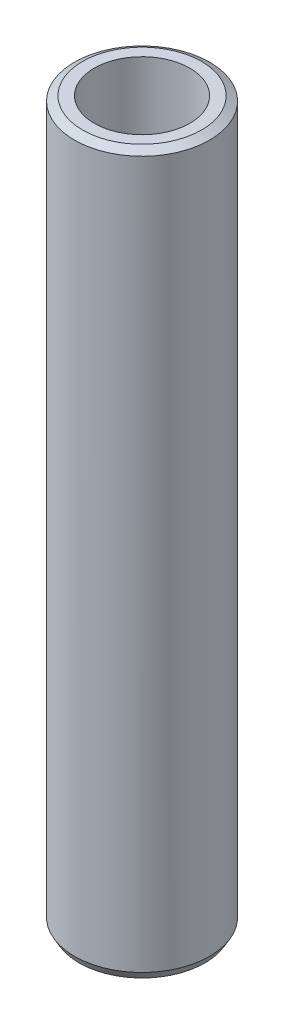
ISO-10303-21;
HEADER;
FILE_DESCRIPTION(('STEP AP214'),'2;1');
FILE_NAME('part.step','',(''),(''),'','','');
FILE_SCHEMA(('AUTOMOTIVE_DESIGN { 1 0 10303 214 1 1 1 1 }'));
ENDSEC;
DATA;
#1=APPLICATION_CONTEXT('core data for automotive mechanical design processes');
#2=APPLICATION_PROTOCOL_DEFINITION('international standard','automotive_design',2000,#1);
#3=PRODUCT_CONTEXT('',#1,'mechanical');
#4=PRODUCT('Part','Part','',(#3));
#5=PRODUCT_RELATED_PRODUCT_CATEGORY('part','',(#4));
#6=PRODUCT_DEFINITION_FORMATION('','',#4);
#7=PRODUCT_DEFINITION_CONTEXT('part definition',#1,'design');
#8=PRODUCT_DEFINITION('design','',#6,#7);
#9=PRODUCT_DEFINITION_SHAPE('','',#8);
#10=(LENGTH_UNIT() NAMED_UNIT(*) SI_UNIT(.MILLI.,.METRE.));
#11=(NAMED_UNIT(*) PLANE_ANGLE_UNIT() SI_UNIT($,.RADIAN.));
#12=(NAMED_UNIT(*) SI_UNIT($,.STERADIAN.) SOLID_ANGLE_UNIT());
#13=UNCERTAINTY_MEASURE_WITH_UNIT(LENGTH_MEASURE(1.E-05),#10,'distance_accuracy_value','');
#14=(GEOMETRIC_REPRESENTATION_CONTEXT(3) GLOBAL_UNCERTAINTY_ASSIGNED_CONTEXT((#13)) GLOBAL_UNIT_ASSIGNED_CONTEXT((#10,
#11,#12)) REPRESENTATION_CONTEXT('',''));
#15=CARTESIAN_POINT('',(0.,0.,0.));
#16=DIRECTION('',(0.,0.,1.));
#17=DIRECTION('',(1.,0.,0.));
#18=AXIS2_PLACEMENT_3D('',#15,#16,#17);
#19=CARTESIAN_POINT('',(0.,425.990256327083,0.));
#20=DIRECTION('',(0.,-1.,0.));
#21=DIRECTION('',(0.,0.,-1.));
#22=AXIS2_PLACEMENT_3D('',#19,#20,#21);
#23=CYLINDRICAL_SURFACE('',#22,40.);
#24=CARTESIAN_POINT('',(0.,423.223731019234,0.));
#25=DIRECTION('',(0.,1.,0.));
#26=DIRECTION('',(0.,0.,1.));
#27=AXIS2_PLACEMENT_3D('',#24,#25,#26);
#28=CIRCLE('',#27,40.);
#29=CARTESIAN_POINT('',(0.,423.223731019234,-40.));
#30=VERTEX_POINT('',#29);
#31=EDGE_CURVE('E50',#30,#30,#28,.F.);
#32=CARTESIAN_POINT('',(0.,4.79176239362122,0.));
#33=DIRECTION('',(0.,1.,0.));
#34=DIRECTION('',(0.,0.,1.));
#35=AXIS2_PLACEMENT_3D('',#32,#33,#34);
#36=CIRCLE('',#35,40.);
#37=CARTESIAN_POINT('',(0.,4.79176239362117,-40.));
#38=VERTEX_POINT('',#37);
#39=EDGE_CURVE('E51',#38,#38,#36,.T.);
#40=CARTESIAN_POINT('',(0.,423.223731019234,-40.));
#41=CARTESIAN_POINT('',(0.,418.865064679384,-40.));
#42=CARTESIAN_POINT('',(0.,414.506398339533,-40.));
#43=CARTESIAN_POINT('',(0.,405.789065659833,-40.));
#44=CARTESIAN_POINT('',(0.,401.430399319983,-40.));
#45=CARTESIAN_POINT('',(0.,392.713066640283,-40.));
#46=CARTESIAN_POINT('',(0.,388.354400300433,-40.));
#47=CARTESIAN_POINT('',(0.,379.637067620732,-40.));
#48=CARTESIAN_POINT('',(0.,375.278401280882,-40.));
#49=CARTESIAN_POINT('',(0.,366.561068601182,-40.));
#50=CARTESIAN_POINT('',(0.,362.202402261332,-40.));
#51=CARTESIAN_POINT('',(0.,353.485069581632,-40.));
#52=CARTESIAN_POINT('',(0.,349.126403241781,-40.));
#53=CARTESIAN_POINT('',(0.,340.409070562081,-40.));
#54=CARTESIAN_POINT('',(0.,336.050404222231,-40.));
#55=CARTESIAN_POINT('',(0.,327.333071542531,-40.));
#56=CARTESIAN_POINT('',(0.,322.974405202681,-40.));
#57=CARTESIAN_POINT('',(0.,314.25707252298,-40.));
#58=CARTESIAN_POINT('',(0.,309.89840618313,-40.));
#59=CARTESIAN_POINT('',(0.,301.18107350343,-40.));
#60=CARTESIAN_POINT('',(0.,296.82240716358,-40.));
#61=CARTESIAN_POINT('',(0.,288.10507448388,-40.));
#62=CARTESIAN_POINT('',(0.,283.746408144029,-40.));
#63=CARTESIAN_POINT('',(0.,275.029075464329,-40.));
#64=CARTESIAN_POINT('',(0.,270.670409124479,-40.));
#65=CARTESIAN_POINT('',(0.,261.953076444779,-40.));
#66=CARTESIAN_POINT('',(0.,257.594410104929,-40.));
#67=CARTESIAN_POINT('',(0.,248.877077425228,-40.));
#68=CARTESIAN_POINT('',(0.,244.518411085378,-40.));
#69=CARTESIAN_POINT('',(0.,235.801078405678,-40.));
#70=CARTESIAN_POINT('',(0.,231.442412065828,-40.));
#71=CARTESIAN_POINT('',(0.,222.725079386128,-40.));
#72=CARTESIAN_POINT('',(0.,218.366413046278,-40.));
#73=CARTESIAN_POINT('',(0.,209.649080366577,-40.));
#74=CARTESIAN_POINT('',(0.,205.290414026727,-40.));
#75=CARTESIAN_POINT('',(0.,196.573081347027,-40.));
#76=CARTESIAN_POINT('',(0.,192.214415007177,-40.));
#77=CARTESIAN_POINT('',(0.,183.497082327477,-40.));
#78=CARTESIAN_POINT('',(0.,179.138415987626,-40.));
#79=CARTESIAN_POINT('',(0.,170.421083307926,-40.));
#80=CARTESIAN_POINT('',(0.,166.062416968076,-40.));
#81=CARTESIAN_POINT('',(0.,157.345084288376,-40.));
#82=CARTESIAN_POINT('',(0.,152.986417948526,-40.));
#83=CARTESIAN_POINT('',(0.,144.269085268825,-40.));
#84=CARTESIAN_POINT('',(0.,139.910418928975,-40.));
#85=CARTESIAN_POINT('',(0.,131.193086249275,-40.));
#86=CARTESIAN_POINT('',(0.,126.834419909425,-40.));
#87=CARTESIAN_POINT('',(0.,118.117087229725,-40.));
#88=CARTESIAN_POINT('',(0.,113.758420889874,-40.));
#89=CARTESIAN_POINT('',(0.,105.041088210174,-40.));
#90=CARTESIAN_POINT('',(0.,100.682421870324,-40.));
#91=CARTESIAN_POINT('',(0.,91.9650891906238,-40.));
#92=CARTESIAN_POINT('',(0.,87.6064228507737,-40.));
#93=CARTESIAN_POINT('',(0.,78.8890901710734,-40.));
#94=CARTESIAN_POINT('',(0.,74.5304238312233,-40.));
#95=CARTESIAN_POINT('',(0.,65.813091151523,-40.));
#96=CARTESIAN_POINT('',(0.,61.4544248116729,-40.));
#97=CARTESIAN_POINT('',(0.,52.7370921319726,-40.));
#98=CARTESIAN_POINT('',(0.,48.3784257921225,-40.));
#99=CARTESIAN_POINT('',(0.,39.6610931124223,-40.));
#100=CARTESIAN_POINT('',(0.,35.3024267725721,-40.));
#101=CARTESIAN_POINT('',(0.,26.5850940928719,-40.));
#102=CARTESIAN_POINT('',(0.,22.2264277530217,-40.));
#103=CARTESIAN_POINT('',(0.,13.5090950733214,-40.));
#104=CARTESIAN_POINT('',(0.,9.15042873347128,-40.));
#105=CARTESIAN_POINT('',(0.,4.79176239362117,-40.));
#106=B_SPLINE_CURVE_WITH_KNOTS('',3,(#40,#41,#42,#43,#44,#45,#46,#47,#48,#49,#50,#51,#52,#53,
#54,#55,#56,#57,#58,#59,#60,#61,#62,#63,#64,#65,#66,#67,#68,#69,#70,#71,#72,#73,#74,#75,#76,#77,
#78,#79,#80,#81,#82,#83,#84,#85,#86,#87,#88,#89,#90,#91,#92,#93,#94,#95,#96,#97,#98,#99,#100,
#101,#102,#103,#104,#105),.UNSPECIFIED.,.F.,.F.,(4,2,2,2,2,2,2,2,2,2,2,2,2,2,2,2,2,2,2,2,2,2,2,
2,2,2,2,2,2,2,2,2,4),(0.,13.0759990195504,26.1519980391008,39.2279970586512,52.3039960782016,
65.379995097752,78.4559941173024,91.5319931368527,104.607992156403,117.683991175954,
130.759990195504,143.835989215054,156.911988234605,169.987987254155,183.063986273705,
196.139985293256,209.215984312806,222.291983332357,235.367982351907,248.443981371457,
261.519980391008,274.595979410558,287.671978430109,300.747977449659,313.823976469209,
326.89997548876,339.97597450831,353.051973527861,366.127972547411,379.203971566961,
392.279970586512,405.355969606062,418.431968625613),.UNSPECIFIED.);
#107=EDGE_CURVE('BSEAM39',#30,#38,#106,.T.);
#108=ORIENTED_EDGE('',*,*,#31,.T.);
#109=ORIENTED_EDGE('',*,*,#39,.T.);
#110=ORIENTED_EDGE('',*,*,#107,.T.);
#111=ORIENTED_EDGE('',*,*,#107,.F.);
#112=EDGE_LOOP('',(#108,#110,#109,#111));
#113=FACE_BOUND('',#112,.T.);
#114=ADVANCED_FACE('F39',(#113),#23,.T.);
#115=CARTESIAN_POINT('',(0.,425.990256327083,0.));
#116=DIRECTION('',(0.,1.,0.));
#117=DIRECTION('',(0.,0.,1.));
#118=AXIS2_PLACEMENT_3D('',#115,#116,#117);
#119=PLANE('',#118);
#120=CARTESIAN_POINT('',(0.,425.990256327083,0.));
#121=DIRECTION('',(0.,1.,0.));
#122=DIRECTION('',(0.,0.,1.));
#123=AXIS2_PLACEMENT_3D('',#120,#121,#122);
#124=CIRCLE('',#123,35.2082376063796);
#125=CARTESIAN_POINT('',(0.,425.990256327083,35.2082376063796));
#126=VERTEX_POINT('',#125);
#127=EDGE_CURVE('E54',#126,#126,#124,.T.);
#128=ORIENTED_EDGE('',*,*,#127,.T.);
#129=EDGE_LOOP('',(#128));
#130=FACE_BOUND('',#129,.T.);
#131=CARTESIAN_POINT('',(0.,425.990256327083,0.));
#132=DIRECTION('',(0.,1.,0.));
#133=DIRECTION('',(0.,0.,1.));
#134=AXIS2_PLACEMENT_3D('',#131,#132,#133);
#135=CIRCLE('',#134,28.3068310248197);
#136=CARTESIAN_POINT('',(0.,425.990256327083,-28.3068310248197));
#137=VERTEX_POINT('',#136);
#138=EDGE_CURVE('E58',#137,#137,#135,.T.);
#139=ORIENTED_EDGE('',*,*,#138,.F.);
#140=EDGE_LOOP('',(#139));
#141=FACE_BOUND('',#140,.T.);
#142=ADVANCED_FACE('F69',(#130,#141),#119,.T.);
#143=CARTESIAN_POINT('',(0.,0.,0.));
#144=DIRECTION('',(0.,1.,0.));
#145=DIRECTION('',(0.,0.,1.));
#146=AXIS2_PLACEMENT_3D('',#143,#144,#145);
#147=PLANE('',#146);
#148=CARTESIAN_POINT('',(0.,0.,0.));
#149=DIRECTION('',(0.,1.,0.));
#150=DIRECTION('',(0.,0.,1.));
#151=AXIS2_PLACEMENT_3D('',#148,#149,#150);
#152=CIRCLE('',#151,37.23347469215);
#153=CARTESIAN_POINT('',(0.,0.,37.23347469215));
#154=VERTEX_POINT('',#153);
#155=EDGE_CURVE('E10',#154,#154,#152,.F.);
#156=ORIENTED_EDGE('',*,*,#155,.T.);
#157=EDGE_LOOP('',(#156));
#158=FACE_BOUND('',#157,.T.);
#159=CARTESIAN_POINT('',(0.,0.,0.));
#160=DIRECTION('',(0.,1.,0.));
#161=DIRECTION('',(0.,0.,1.));
#162=AXIS2_PLACEMENT_3D('',#159,#160,#161);
#163=CIRCLE('',#162,28.3068310248197);
#164=CARTESIAN_POINT('',(0.,0.,-28.3068310248197));
#165=VERTEX_POINT('',#164);
#166=EDGE_CURVE('E63',#165,#165,#163,.T.);
#167=ORIENTED_EDGE('',*,*,#166,.T.);
#168=EDGE_LOOP('',(#167));
#169=FACE_BOUND('',#168,.T.);
#170=ADVANCED_FACE('F75',(#158,#169),#147,.F.);
#171=CARTESIAN_POINT('',(0.,425.990256327083,0.));
#172=DIRECTION('',(0.,-1.,0.));
#173=DIRECTION('',(0.,0.,-1.));
#174=AXIS2_PLACEMENT_3D('',#171,#172,#173);
#175=CYLINDRICAL_SURFACE('',#174,28.3068310248197);
#176=CARTESIAN_POINT('',(0.,425.990256327083,-28.3068310248197));
#177=CARTESIAN_POINT('',(0.,421.552857823676,-28.3068310248197));
#178=CARTESIAN_POINT('',(0.,417.115459320269,-28.3068310248197));
#179=CARTESIAN_POINT('',(0.,408.240662313455,-28.3068310248197));
#180=CARTESIAN_POINT('',(0.,403.803263810047,-28.3068310248197));
#181=CARTESIAN_POINT('',(0.,394.928466803233,-28.3068310248197));
#182=CARTESIAN_POINT('',(0.,390.491068299826,-28.3068310248197));
#183=CARTESIAN_POINT('',(0.,381.616271293012,-28.3068310248197));
#184=CARTESIAN_POINT('',(0.,377.178872789605,-28.3068310248197));
#185=CARTESIAN_POINT('',(0.,368.304075782791,-28.3068310248197));
#186=CARTESIAN_POINT('',(0.,363.866677279384,-28.3068310248197));
#187=CARTESIAN_POINT('',(0.,354.991880272569,-28.3068310248197));
#188=CARTESIAN_POINT('',(0.,350.554481769162,-28.3068310248197));
#189=CARTESIAN_POINT('',(0.,341.679684762348,-28.3068310248197));
#190=CARTESIAN_POINT('',(0.,337.242286258941,-28.3068310248197));
#191=CARTESIAN_POINT('',(0.,328.367489252127,-28.3068310248197));
#192=CARTESIAN_POINT('',(0.,323.930090748719,-28.3068310248197));
#193=CARTESIAN_POINT('',(0.,315.055293741905,-28.3068310248197));
#194=CARTESIAN_POINT('',(0.,310.617895238498,-28.3068310248197));
#195=CARTESIAN_POINT('',(0.,301.743098231684,-28.3068310248197));
#196=CARTESIAN_POINT('',(0.,297.305699728277,-28.3068310248197));
#197=CARTESIAN_POINT('',(0.,288.430902721462,-28.3068310248197));
#198=CARTESIAN_POINT('',(0.,283.993504218055,-28.3068310248197));
#199=CARTESIAN_POINT('',(0.,275.118707211241,-28.3068310248197));
#200=CARTESIAN_POINT('',(0.,270.681308707834,-28.3068310248197));
#201=CARTESIAN_POINT('',(0.,261.80651170102,-28.3068310248197));
#202=CARTESIAN_POINT('',(0.,257.369113197613,-28.3068310248197));
#203=CARTESIAN_POINT('',(0.,248.494316190798,-28.3068310248197));
#204=CARTESIAN_POINT('',(0.,244.056917687391,-28.3068310248197));
#205=CARTESIAN_POINT('',(0.,235.182120680577,-28.3068310248197));
#206=CARTESIAN_POINT('',(0.,230.74472217717,-28.3068310248197));
#207=CARTESIAN_POINT('',(0.,221.869925170356,-28.3068310248197));
#208=CARTESIAN_POINT('',(0.,217.432526666949,-28.3068310248197));
#209=CARTESIAN_POINT('',(0.,208.557729660134,-28.3068310248197));
#210=CARTESIAN_POINT('',(0.,204.120331156727,-28.3068310248197));
#211=CARTESIAN_POINT('',(0.,195.245534149913,-28.3068310248197));
#212=CARTESIAN_POINT('',(0.,190.808135646506,-28.3068310248197));
#213=CARTESIAN_POINT('',(0.,181.933338639692,-28.3068310248197));
#214=CARTESIAN_POINT('',(0.,177.495940136285,-28.3068310248197));
#215=CARTESIAN_POINT('',(0.,168.62114312947,-28.3068310248197));
#216=CARTESIAN_POINT('',(0.,164.183744626063,-28.3068310248197));
#217=CARTESIAN_POINT('',(0.,155.308947619249,-28.3068310248197));
#218=CARTESIAN_POINT('',(0.,150.871549115842,-28.3068310248197));
#219=CARTESIAN_POINT('',(0.,141.996752109028,-28.3068310248197));
#220=CARTESIAN_POINT('',(0.,137.559353605621,-28.3068310248197));
#221=CARTESIAN_POINT('',(0.,128.684556598806,-28.3068310248197));
#222=CARTESIAN_POINT('',(0.,124.247158095399,-28.3068310248197));
#223=CARTESIAN_POINT('',(0.,115.372361088585,-28.3068310248197));
#224=CARTESIAN_POINT('',(0.,110.934962585178,-28.3068310248197));
#225=CARTESIAN_POINT('',(0.,102.060165578364,-28.3068310248197));
#226=CARTESIAN_POINT('',(0.,97.6227670749565,-28.3068310248197));
#227=CARTESIAN_POINT('',(0.,88.7479700681423,-28.3068310248197));
#228=CARTESIAN_POINT('',(0.,84.3105715647351,-28.3068310248197));
#229=CARTESIAN_POINT('',(0.,75.4357745579209,-28.3068310248197));
#230=CARTESIAN_POINT('',(0.,70.9983760545138,-28.3068310248197));
#231=CARTESIAN_POINT('',(0.,62.1235790476996,-28.3068310248197));
#232=CARTESIAN_POINT('',(0.,57.6861805442925,-28.3068310248197));
#233=CARTESIAN_POINT('',(0.,48.8113835374782,-28.3068310248197));
#234=CARTESIAN_POINT('',(0.,44.3739850340711,-28.3068310248197));
#235=CARTESIAN_POINT('',(0.,35.4991880272569,-28.3068310248197));
#236=CARTESIAN_POINT('',(0.,31.0617895238497,-28.3068310248197));
#237=CARTESIAN_POINT('',(0.,22.1869925170355,-28.3068310248197));
#238=CARTESIAN_POINT('',(0.,17.7495940136284,-28.3068310248197));
#239=CARTESIAN_POINT('',(0.,8.87479700681417,-28.3068310248197));
#240=CARTESIAN_POINT('',(0.,4.43739850340706,-28.3068310248197));
#241=CARTESIAN_POINT('',(0.,0.,-28.3068310248197));
#242=B_SPLINE_CURVE_WITH_KNOTS('',3,(#176,#177,#178,#179,#180,#181,#182,#183,#184,#185,#186,
#187,#188,#189,#190,#191,#192,#193,#194,#195,#196,#197,#198,#199,#200,#201,#202,#203,#204,#205,
#206,#207,#208,#209,#210,#211,#212,#213,#214,#215,#216,#217,#218,#219,#220,#221,#222,#223,#224,
#225,#226,#227,#228,#229,#230,#231,#232,#233,#234,#235,#236,#237,#238,#239,#240,#241),
.UNSPECIFIED.,.F.,.F.,(4,2,2,2,2,2,2,2,2,2,2,2,2,2,2,2,2,2,2,2,2,2,2,2,2,2,2,2,2,2,2,2,4),(0.,
13.3121955102213,26.6243910204427,39.936586530664,53.2487820408853,66.5609775511067,
79.8731730613281,93.1853685715494,106.497564081771,119.809759591992,133.121955102213,
146.434150612435,159.746346122656,173.058541632877,186.370737143099,199.68293265332,
212.995128163542,226.307323673763,239.619519183984,252.931714694206,266.243910204427,
279.556105714648,292.86830122487,306.180496735091,319.492692245312,332.804887755534,
346.117083265755,359.429278775976,372.741474286198,386.053669796419,399.36586530664,
412.678060816862,425.990256327083),.UNSPECIFIED.);
#243=EDGE_CURVE('BSEAM70',#137,#165,#242,.T.);
#244=ORIENTED_EDGE('',*,*,#138,.T.);
#245=ORIENTED_EDGE('',*,*,#166,.F.);
#246=ORIENTED_EDGE('',*,*,#243,.T.);
#247=ORIENTED_EDGE('',*,*,#243,.F.);
#248=EDGE_LOOP('',(#244,#246,#245,#247));
#249=FACE_BOUND('',#248,.T.);
#250=ADVANCED_FACE('F70',(#249),#175,.F.);
#251=CARTESIAN_POINT('',(0.,425.990256327083,0.));
#252=DIRECTION('',(0.,-1.,0.));
#253=DIRECTION('',(0.,0.,-1.));
#254=AXIS2_PLACEMENT_3D('',#251,#252,#253);
#255=CONICAL_SURFACE('',#254,35.2082376063796,1.0471975511966);
#256=ORIENTED_EDGE('',*,*,#31,.F.);
#257=EDGE_LOOP('',(#256));
#258=FACE_BOUND('',#257,.T.);
#259=ORIENTED_EDGE('',*,*,#127,.F.);
#260=EDGE_LOOP('',(#259));
#261=FACE_BOUND('',#260,.T.);
#262=ADVANCED_FACE('F81',(#258,#261),#255,.T.);
#263=CARTESIAN_POINT('',(0.,4.79176239362122,0.));
#264=DIRECTION('',(0.,1.,0.));
#265=DIRECTION('',(0.,0.,1.));
#266=AXIS2_PLACEMENT_3D('',#263,#264,#265);
#267=CONICAL_SURFACE('',#266,40.,0.523598775598306);
#268=ORIENTED_EDGE('',*,*,#155,.F.);
#269=EDGE_LOOP('',(#268));
#270=FACE_BOUND('',#269,.T.);
#271=ORIENTED_EDGE('',*,*,#39,.F.);
#272=EDGE_LOOP('',(#271));
#273=FACE_BOUND('',#272,.T.);
#274=ADVANCED_FACE('F45',(#270,#273),#267,.T.);
#275=CLOSED_SHELL('',(#114,#142,#170,#250,#262,#274));
#276=MANIFOLD_SOLID_BREP('B2',#275);
#277=ADVANCED_BREP_SHAPE_REPRESENTATION('',(#18,#276),#14);
#278=SHAPE_DEFINITION_REPRESENTATION(#9,#277);
ENDSEC;
END-ISO-10303-21;
